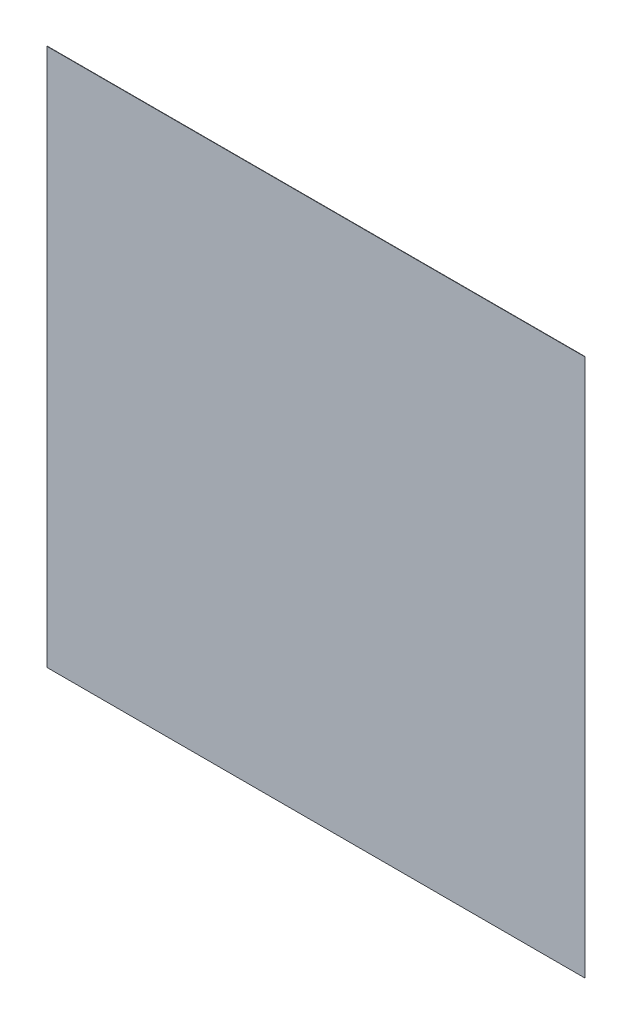
ISO-10303-21;
HEADER;
FILE_DESCRIPTION(('STEP AP214'),'2;1');
FILE_NAME('part.step','',(''),(''),'','','');
FILE_SCHEMA(('AUTOMOTIVE_DESIGN { 1 0 10303 214 1 1 1 1 }'));
ENDSEC;
DATA;
#1=APPLICATION_CONTEXT('core data for automotive mechanical design processes');
#2=APPLICATION_PROTOCOL_DEFINITION('international standard','automotive_design',2000,#1);
#3=PRODUCT_CONTEXT('',#1,'mechanical');
#4=PRODUCT('Part','Part','',(#3));
#5=PRODUCT_RELATED_PRODUCT_CATEGORY('part','',(#4));
#6=PRODUCT_DEFINITION_FORMATION('','',#4);
#7=PRODUCT_DEFINITION_CONTEXT('part definition',#1,'design');
#8=PRODUCT_DEFINITION('design','',#6,#7);
#9=PRODUCT_DEFINITION_SHAPE('','',#8);
#10=(LENGTH_UNIT() NAMED_UNIT(*) SI_UNIT(.MILLI.,.METRE.));
#11=(NAMED_UNIT(*) PLANE_ANGLE_UNIT() SI_UNIT($,.RADIAN.));
#12=(NAMED_UNIT(*) SI_UNIT($,.STERADIAN.) SOLID_ANGLE_UNIT());
#13=UNCERTAINTY_MEASURE_WITH_UNIT(LENGTH_MEASURE(1.E-05),#10,'distance_accuracy_value','');
#14=(GEOMETRIC_REPRESENTATION_CONTEXT(3) GLOBAL_UNCERTAINTY_ASSIGNED_CONTEXT((#13)) GLOBAL_UNIT_ASSIGNED_CONTEXT((#10,
#11,#12)) REPRESENTATION_CONTEXT('',''));
#15=CARTESIAN_POINT('',(0.,0.,0.));
#16=DIRECTION('',(0.,0.,1.));
#17=DIRECTION('',(1.,0.,0.));
#18=AXIS2_PLACEMENT_3D('',#15,#16,#17);
#19=CARTESIAN_POINT('',(-265.,265.,0.35));
#20=DIRECTION('',(1.,0.,0.));
#21=DIRECTION('',(0.,1.,0.));
#22=AXIS2_PLACEMENT_3D('',#19,#20,#21);
#23=PLANE('',#22);
#24=DIRECTION('',(0.,-1.,0.));
#25=VECTOR('',#24,1.);
#26=CARTESIAN_POINT('',(-265.,265.,0.));
#27=LINE('',#26,#25);
#28=CARTESIAN_POINT('',(-265.,265.,0.));
#29=VERTEX_POINT('',#28);
#30=CARTESIAN_POINT('',(-265.,-265.,0.));
#31=VERTEX_POINT('',#30);
#32=EDGE_CURVE('E107',#29,#31,#27,.T.);
#33=ORIENTED_EDGE('',*,*,#32,.T.);
#34=DIRECTION('',(0.,0.,-1.));
#35=VECTOR('',#34,1.);
#36=CARTESIAN_POINT('',(-265.,-265.,0.35));
#37=LINE('',#36,#35);
#38=CARTESIAN_POINT('',(-265.,-265.,0.35));
#39=VERTEX_POINT('',#38);
#40=EDGE_CURVE('E11',#39,#31,#37,.T.);
#41=ORIENTED_EDGE('',*,*,#40,.F.);
#42=DIRECTION('',(0.,-1.,0.));
#43=VECTOR('',#42,1.);
#44=CARTESIAN_POINT('',(-265.,265.,0.35));
#45=LINE('',#44,#43);
#46=CARTESIAN_POINT('',(-265.,265.,0.35));
#47=VERTEX_POINT('',#46);
#48=EDGE_CURVE('E91',#47,#39,#45,.T.);
#49=ORIENTED_EDGE('',*,*,#48,.F.);
#50=DIRECTION('',(0.,0.,-1.));
#51=VECTOR('',#50,1.);
#52=CARTESIAN_POINT('',(-265.,265.,0.35));
#53=LINE('',#52,#51);
#54=EDGE_CURVE('E103',#47,#29,#53,.T.);
#55=ORIENTED_EDGE('',*,*,#54,.T.);
#56=EDGE_LOOP('',(#33,#41,#49,#55));
#57=FACE_BOUND('',#56,.T.);
#58=ADVANCED_FACE('F39',(#57),#23,.F.);
#59=CARTESIAN_POINT('',(265.,-265.,0.35));
#60=DIRECTION('',(0.,1.,0.));
#61=DIRECTION('',(-1.,0.,0.));
#62=AXIS2_PLACEMENT_3D('',#59,#60,#61);
#63=PLANE('',#62);
#64=DIRECTION('',(1.,0.,0.));
#65=VECTOR('',#64,1.);
#66=CARTESIAN_POINT('',(265.,-265.,0.));
#67=LINE('',#66,#65);
#68=CARTESIAN_POINT('',(265.,-265.,0.));
#69=VERTEX_POINT('',#68);
#70=EDGE_CURVE('E96',#31,#69,#67,.T.);
#71=ORIENTED_EDGE('',*,*,#70,.T.);
#72=DIRECTION('',(0.,0.,-1.));
#73=VECTOR('',#72,1.);
#74=CARTESIAN_POINT('',(265.,-265.,0.35));
#75=LINE('',#74,#73);
#76=CARTESIAN_POINT('',(265.,-265.,0.35));
#77=VERTEX_POINT('',#76);
#78=EDGE_CURVE('E48',#77,#69,#75,.T.);
#79=ORIENTED_EDGE('',*,*,#78,.F.);
#80=DIRECTION('',(1.,0.,0.));
#81=VECTOR('',#80,1.);
#82=CARTESIAN_POINT('',(265.,-265.,0.35));
#83=LINE('',#82,#81);
#84=EDGE_CURVE('E86',#39,#77,#83,.T.);
#85=ORIENTED_EDGE('',*,*,#84,.F.);
#86=ORIENTED_EDGE('',*,*,#40,.T.);
#87=EDGE_LOOP('',(#71,#79,#85,#86));
#88=FACE_BOUND('',#87,.T.);
#89=ADVANCED_FACE('F95',(#88),#63,.F.);
#90=CARTESIAN_POINT('',(265.,265.,0.35));
#91=DIRECTION('',(-1.,0.,0.));
#92=DIRECTION('',(0.,-1.,0.));
#93=AXIS2_PLACEMENT_3D('',#90,#91,#92);
#94=PLANE('',#93);
#95=DIRECTION('',(0.,1.,0.));
#96=VECTOR('',#95,1.);
#97=CARTESIAN_POINT('',(265.,265.,0.));
#98=LINE('',#97,#96);
#99=CARTESIAN_POINT('',(265.,265.,0.));
#100=VERTEX_POINT('',#99);
#101=EDGE_CURVE('E73',#69,#100,#98,.T.);
#102=ORIENTED_EDGE('',*,*,#101,.T.);
#103=DIRECTION('',(0.,0.,-1.));
#104=VECTOR('',#103,1.);
#105=CARTESIAN_POINT('',(265.,265.,0.35));
#106=LINE('',#105,#104);
#107=CARTESIAN_POINT('',(265.,265.,0.35));
#108=VERTEX_POINT('',#107);
#109=EDGE_CURVE('E98',#108,#100,#106,.T.);
#110=ORIENTED_EDGE('',*,*,#109,.F.);
#111=DIRECTION('',(0.,1.,0.));
#112=VECTOR('',#111,1.);
#113=CARTESIAN_POINT('',(265.,265.,0.35));
#114=LINE('',#113,#112);
#115=EDGE_CURVE('E89',#77,#108,#114,.T.);
#116=ORIENTED_EDGE('',*,*,#115,.F.);
#117=ORIENTED_EDGE('',*,*,#78,.T.);
#118=EDGE_LOOP('',(#102,#110,#116,#117));
#119=FACE_BOUND('',#118,.T.);
#120=ADVANCED_FACE('F99',(#119),#94,.F.);
#121=CARTESIAN_POINT('',(265.,265.,0.35));
#122=DIRECTION('',(0.,-1.,0.));
#123=DIRECTION('',(1.,0.,0.));
#124=AXIS2_PLACEMENT_3D('',#121,#122,#123);
#125=PLANE('',#124);
#126=DIRECTION('',(-1.,0.,0.));
#127=VECTOR('',#126,1.);
#128=CARTESIAN_POINT('',(265.,265.,0.));
#129=LINE('',#128,#127);
#130=EDGE_CURVE('E79',#100,#29,#129,.T.);
#131=ORIENTED_EDGE('',*,*,#130,.T.);
#132=ORIENTED_EDGE('',*,*,#54,.F.);
#133=DIRECTION('',(-1.,0.,0.));
#134=VECTOR('',#133,1.);
#135=CARTESIAN_POINT('',(265.,265.,0.35));
#136=LINE('',#135,#134);
#137=EDGE_CURVE('E56',#108,#47,#136,.T.);
#138=ORIENTED_EDGE('',*,*,#137,.F.);
#139=ORIENTED_EDGE('',*,*,#109,.T.);
#140=EDGE_LOOP('',(#131,#132,#138,#139));
#141=FACE_BOUND('',#140,.T.);
#142=ADVANCED_FACE('F120',(#141),#125,.F.);
#143=CARTESIAN_POINT('',(0.,0.,0.35));
#144=DIRECTION('',(0.,0.,-1.));
#145=DIRECTION('',(-1.,0.,0.));
#146=AXIS2_PLACEMENT_3D('',#143,#144,#145);
#147=PLANE('',#146);
#148=ORIENTED_EDGE('',*,*,#48,.T.);
#149=ORIENTED_EDGE('',*,*,#84,.T.);
#150=ORIENTED_EDGE('',*,*,#115,.T.);
#151=ORIENTED_EDGE('',*,*,#137,.T.);
#152=EDGE_LOOP('',(#148,#149,#150,#151));
#153=FACE_BOUND('',#152,.T.);
#154=ADVANCED_FACE('F87',(#153),#147,.F.);
#155=CARTESIAN_POINT('',(0.,0.,0.));
#156=DIRECTION('',(0.,0.,-1.));
#157=DIRECTION('',(-1.,0.,0.));
#158=AXIS2_PLACEMENT_3D('',#155,#156,#157);
#159=PLANE('',#158);
#160=ORIENTED_EDGE('',*,*,#32,.F.);
#161=ORIENTED_EDGE('',*,*,#130,.F.);
#162=ORIENTED_EDGE('',*,*,#101,.F.);
#163=ORIENTED_EDGE('',*,*,#70,.F.);
#164=EDGE_LOOP('',(#160,#161,#162,#163));
#165=FACE_BOUND('',#164,.T.);
#166=ADVANCED_FACE('F123',(#165),#159,.T.);
#167=CLOSED_SHELL('',(#58,#89,#120,#142,#154,#166));
#168=MANIFOLD_SOLID_BREP('B2',#167);
#169=ADVANCED_BREP_SHAPE_REPRESENTATION('',(#18,#168),#14);
#170=SHAPE_DEFINITION_REPRESENTATION(#9,#169);
ENDSEC;
END-ISO-10303-21;
